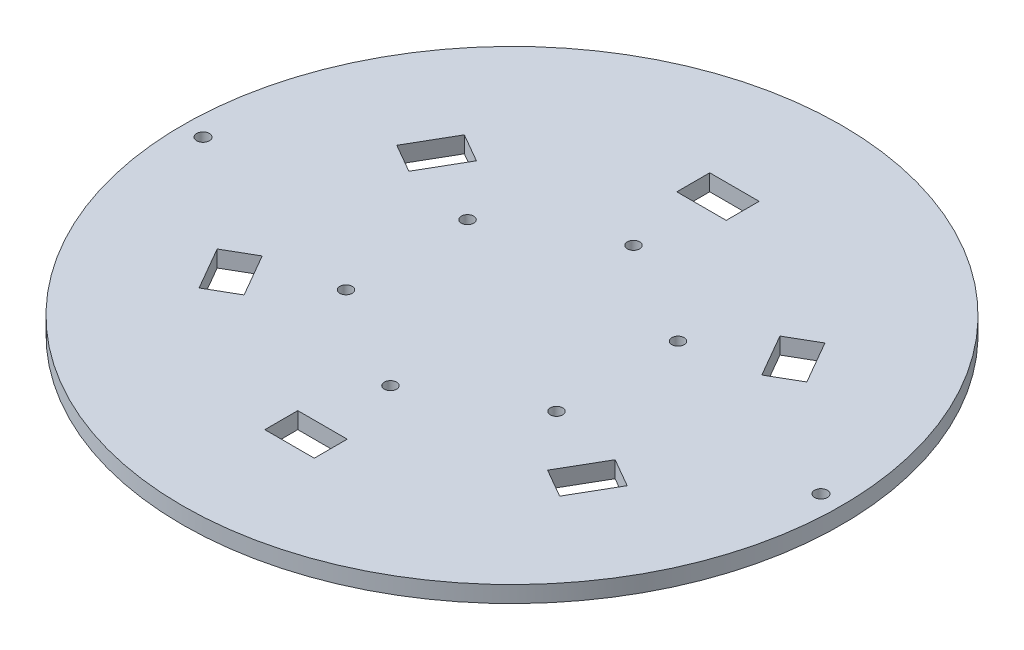
ISO-10303-21;
HEADER;
FILE_DESCRIPTION(('STEP AP214'),'2;1');
FILE_NAME('part.step','',(''),(''),'','','');
FILE_SCHEMA(('AUTOMOTIVE_DESIGN { 1 0 10303 214 1 1 1 1 }'));
ENDSEC;
DATA;
#1=APPLICATION_CONTEXT('core data for automotive mechanical design processes');
#2=APPLICATION_PROTOCOL_DEFINITION('international standard','automotive_design',2000,#1);
#3=PRODUCT_CONTEXT('',#1,'mechanical');
#4=PRODUCT('Part','Part','',(#3));
#5=PRODUCT_RELATED_PRODUCT_CATEGORY('part','',(#4));
#6=PRODUCT_DEFINITION_FORMATION('','',#4);
#7=PRODUCT_DEFINITION_CONTEXT('part definition',#1,'design');
#8=PRODUCT_DEFINITION('design','',#6,#7);
#9=PRODUCT_DEFINITION_SHAPE('','',#8);
#10=(LENGTH_UNIT() NAMED_UNIT(*) SI_UNIT(.MILLI.,.METRE.));
#11=(NAMED_UNIT(*) PLANE_ANGLE_UNIT() SI_UNIT($,.RADIAN.));
#12=(NAMED_UNIT(*) SI_UNIT($,.STERADIAN.) SOLID_ANGLE_UNIT());
#13=UNCERTAINTY_MEASURE_WITH_UNIT(LENGTH_MEASURE(1.E-05),#10,'distance_accuracy_value','');
#14=(GEOMETRIC_REPRESENTATION_CONTEXT(3) GLOBAL_UNCERTAINTY_ASSIGNED_CONTEXT((#13)) GLOBAL_UNIT_ASSIGNED_CONTEXT((#10,
#11,#12)) REPRESENTATION_CONTEXT('',''));
#15=CARTESIAN_POINT('',(0.,0.,0.));
#16=DIRECTION('',(0.,0.,1.));
#17=DIRECTION('',(1.,0.,0.));
#18=AXIS2_PLACEMENT_3D('',#15,#16,#17);
#19=CARTESIAN_POINT('',(0.,2.,0.));
#20=DIRECTION('',(0.,-1.,0.));
#21=DIRECTION('',(0.,0.,-1.));
#22=AXIS2_PLACEMENT_3D('',#19,#20,#21);
#23=CYLINDRICAL_SURFACE('',#22,80.);
#24=CARTESIAN_POINT('',(0.,-2.,0.));
#25=DIRECTION('',(0.,1.,0.));
#26=DIRECTION('',(0.,0.,1.));
#27=AXIS2_PLACEMENT_3D('',#24,#25,#26);
#28=CIRCLE('',#27,80.);
#29=CARTESIAN_POINT('',(0.,-2.,80.));
#30=VERTEX_POINT('',#29);
#31=EDGE_CURVE('E46',#30,#30,#28,.T.);
#32=ORIENTED_EDGE('',*,*,#31,.T.);
#33=EDGE_LOOP('',(#32));
#34=FACE_BOUND('',#33,.T.);
#35=CARTESIAN_POINT('',(0.,2.,0.));
#36=DIRECTION('',(0.,1.,0.));
#37=DIRECTION('',(0.,0.,-1.));
#38=AXIS2_PLACEMENT_3D('',#35,#36,#37);
#39=CIRCLE('',#38,80.);
#40=CARTESIAN_POINT('',(0.,2.,-80.));
#41=VERTEX_POINT('',#40);
#42=EDGE_CURVE('E11',#41,#41,#39,.T.);
#43=ORIENTED_EDGE('',*,*,#42,.F.);
#44=EDGE_LOOP('',(#43));
#45=FACE_BOUND('',#44,.T.);
#46=ADVANCED_FACE('F38',(#34,#45),#23,.T.);
#47=CARTESIAN_POINT('',(0.,2.,0.));
#48=DIRECTION('',(0.,-1.,0.));
#49=DIRECTION('',(0.,0.,-1.));
#50=AXIS2_PLACEMENT_3D('',#47,#48,#49);
#51=PLANE('',#50);
#52=CARTESIAN_POINT('',(4.39839137333919E-12,2.,29.4999999999997));
#53=DIRECTION('',(0.,1.,0.));
#54=DIRECTION('',(0.,0.,1.));
#55=AXIS2_PLACEMENT_3D('',#52,#53,#54);
#56=CIRCLE('',#55,1.5);
#57=CARTESIAN_POINT('',(4.39839137333919E-12,2.,30.9999999999997));
#58=VERTEX_POINT('',#57);
#59=EDGE_CURVE('E418',#58,#58,#56,.T.);
#60=ORIENTED_EDGE('',*,*,#59,.F.);
#61=EDGE_LOOP('',(#60));
#62=FACE_BOUND('',#61,.T.);
#63=CARTESIAN_POINT('',(-25.5477494116402,2.,-14.749999999998));
#64=DIRECTION('',(0.,1.,0.));
#65=DIRECTION('',(0.,0.,1.));
#66=AXIS2_PLACEMENT_3D('',#63,#64,#65);
#67=CIRCLE('',#66,1.5);
#68=CARTESIAN_POINT('',(-25.5477494116402,2.,-13.249999999998));
#69=VERTEX_POINT('',#68);
#70=EDGE_CURVE('E468',#69,#69,#67,.T.);
#71=ORIENTED_EDGE('',*,*,#70,.F.);
#72=EDGE_LOOP('',(#71));
#73=FACE_BOUND('',#72,.T.);
#74=CARTESIAN_POINT('',(-25.5477494116377,2.,14.7500000000019));
#75=DIRECTION('',(0.,1.,0.));
#76=DIRECTION('',(0.,0.,1.));
#77=AXIS2_PLACEMENT_3D('',#74,#75,#76);
#78=CIRCLE('',#77,1.5);
#79=CARTESIAN_POINT('',(-25.5477494116377,2.,16.2500000000019));
#80=VERTEX_POINT('',#79);
#81=EDGE_CURVE('E463',#80,#80,#78,.T.);
#82=ORIENTED_EDGE('',*,*,#81,.F.);
#83=EDGE_LOOP('',(#82));
#84=FACE_BOUND('',#83,.T.);
#85=CARTESIAN_POINT('',(25.547749411644,2.,14.7499999999976));
#86=DIRECTION('',(0.,1.,0.));
#87=DIRECTION('',(0.,0.,1.));
#88=AXIS2_PLACEMENT_3D('',#85,#86,#87);
#89=CIRCLE('',#88,1.5);
#90=CARTESIAN_POINT('',(25.547749411644,2.,16.2499999999976));
#91=VERTEX_POINT('',#90);
#92=EDGE_CURVE('E459',#91,#91,#89,.T.);
#93=ORIENTED_EDGE('',*,*,#92,.F.);
#94=EDGE_LOOP('',(#93));
#95=FACE_BOUND('',#94,.T.);
#96=CARTESIAN_POINT('',(25.5477494116415,2.,-14.7500000000023));
#97=DIRECTION('',(0.,1.,0.));
#98=DIRECTION('',(0.,0.,1.));
#99=AXIS2_PLACEMENT_3D('',#96,#97,#98);
#100=CIRCLE('',#99,1.5);
#101=CARTESIAN_POINT('',(25.5477494116415,2.,-13.2500000000023));
#102=VERTEX_POINT('',#101);
#103=EDGE_CURVE('E457',#102,#102,#100,.T.);
#104=ORIENTED_EDGE('',*,*,#103,.F.);
#105=EDGE_LOOP('',(#104));
#106=FACE_BOUND('',#105,.T.);
#107=CARTESIAN_POINT('',(-5.01335084557297E-13,2.,-29.5000000000001));
#108=DIRECTION('',(0.,1.,0.));
#109=DIRECTION('',(0.,0.,1.));
#110=AXIS2_PLACEMENT_3D('',#107,#108,#109);
#111=CIRCLE('',#110,1.5);
#112=CARTESIAN_POINT('',(-5.01335084557297E-13,2.,-28.0000000000001));
#113=VERTEX_POINT('',#112);
#114=EDGE_CURVE('E227',#113,#113,#111,.T.);
#115=ORIENTED_EDGE('',*,*,#114,.F.);
#116=EDGE_LOOP('',(#115));
#117=FACE_BOUND('',#116,.T.);
#118=DIRECTION('',(-1.,0.,0.));
#119=VECTOR('',#118,1.);
#120=CARTESIAN_POINT('',(-6.,2.,-54.));
#121=LINE('',#120,#119);
#122=CARTESIAN_POINT('',(6.,2.,-54.));
#123=VERTEX_POINT('',#122);
#124=CARTESIAN_POINT('',(-6.,2.,-54.));
#125=VERTEX_POINT('',#124);
#126=EDGE_CURVE('E233',#123,#125,#121,.T.);
#127=ORIENTED_EDGE('',*,*,#126,.F.);
#128=DIRECTION('',(0.,0.,-1.));
#129=VECTOR('',#128,1.);
#130=CARTESIAN_POINT('',(6.,2.,-54.));
#131=LINE('',#130,#129);
#132=CARTESIAN_POINT('',(6.,2.,-46.));
#133=VERTEX_POINT('',#132);
#134=EDGE_CURVE('E54',#133,#123,#131,.T.);
#135=ORIENTED_EDGE('',*,*,#134,.F.);
#136=DIRECTION('',(1.,0.,0.));
#137=VECTOR('',#136,1.);
#138=CARTESIAN_POINT('',(-6.,2.,-46.));
#139=LINE('',#138,#137);
#140=CARTESIAN_POINT('',(-6.,2.,-46.));
#141=VERTEX_POINT('',#140);
#142=EDGE_CURVE('E221',#141,#133,#139,.T.);
#143=ORIENTED_EDGE('',*,*,#142,.F.);
#144=DIRECTION('',(0.,0.,1.));
#145=VECTOR('',#144,1.);
#146=CARTESIAN_POINT('',(-6.,2.,-54.));
#147=LINE('',#146,#145);
#148=EDGE_CURVE('E224',#125,#141,#147,.T.);
#149=ORIENTED_EDGE('',*,*,#148,.F.);
#150=EDGE_LOOP('',(#127,#135,#143,#149));
#151=FACE_BOUND('',#150,.T.);
#152=DIRECTION('',(-0.499999999999999,0.,0.866025403784439));
#153=VECTOR('',#152,1.);
#154=CARTESIAN_POINT('',(-49.7653718043585,2.,-21.8038475772918));
#155=LINE('',#154,#153);
#156=CARTESIAN_POINT('',(-43.7653718043585,2.,-32.196152422705));
#157=VERTEX_POINT('',#156);
#158=CARTESIAN_POINT('',(-49.7653718043585,2.,-21.8038475772918));
#159=VERTEX_POINT('',#158);
#160=EDGE_CURVE('E259',#157,#159,#155,.T.);
#161=ORIENTED_EDGE('',*,*,#160,.F.);
#162=DIRECTION('',(-0.866025403784439,0.,-0.5));
#163=VECTOR('',#162,1.);
#164=CARTESIAN_POINT('',(-43.7653718043585,2.,-32.196152422705));
#165=LINE('',#164,#163);
#166=CARTESIAN_POINT('',(-36.837168574083,2.,-28.1961524227051));
#167=VERTEX_POINT('',#166);
#168=EDGE_CURVE('E62',#167,#157,#165,.T.);
#169=ORIENTED_EDGE('',*,*,#168,.F.);
#170=DIRECTION('',(0.499999999999999,0.,-0.866025403784439));
#171=VECTOR('',#170,1.);
#172=CARTESIAN_POINT('',(-42.837168574083,2.,-17.8038475772918));
#173=LINE('',#172,#171);
#174=CARTESIAN_POINT('',(-42.837168574083,2.,-17.8038475772918));
#175=VERTEX_POINT('',#174);
#176=EDGE_CURVE('E248',#175,#167,#173,.T.);
#177=ORIENTED_EDGE('',*,*,#176,.F.);
#178=DIRECTION('',(0.866025403784439,0.,0.5));
#179=VECTOR('',#178,1.);
#180=CARTESIAN_POINT('',(-49.7653718043585,2.,-21.8038475772918));
#181=LINE('',#180,#179);
#182=EDGE_CURVE('E262',#159,#175,#181,.T.);
#183=ORIENTED_EDGE('',*,*,#182,.F.);
#184=EDGE_LOOP('',(#161,#169,#177,#183));
#185=FACE_BOUND('',#184,.T.);
#186=DIRECTION('',(0.5,0.,0.866025403784439));
#187=VECTOR('',#186,1.);
#188=CARTESIAN_POINT('',(-43.7653718043566,2.,32.196152422708));
#189=LINE('',#188,#187);
#190=CARTESIAN_POINT('',(-49.7653718043566,2.,21.8038475772947));
#191=VERTEX_POINT('',#190);
#192=CARTESIAN_POINT('',(-43.7653718043566,2.,32.196152422708));
#193=VERTEX_POINT('',#192);
#194=EDGE_CURVE('E386',#191,#193,#189,.T.);
#195=ORIENTED_EDGE('',*,*,#194,.F.);
#196=DIRECTION('',(-0.866025403784438,0.,0.500000000000001));
#197=VECTOR('',#196,1.);
#198=CARTESIAN_POINT('',(-49.7653718043566,2.,21.8038475772947));
#199=LINE('',#198,#197);
#200=CARTESIAN_POINT('',(-42.8371685740811,2.,17.8038475772947));
#201=VERTEX_POINT('',#200);
#202=EDGE_CURVE('E269',#201,#191,#199,.T.);
#203=ORIENTED_EDGE('',*,*,#202,.F.);
#204=DIRECTION('',(-0.5,0.,-0.866025403784438));
#205=VECTOR('',#204,1.);
#206=CARTESIAN_POINT('',(-36.8371685740811,2.,28.196152422708));
#207=LINE('',#206,#205);
#208=CARTESIAN_POINT('',(-36.8371685740811,2.,28.196152422708));
#209=VERTEX_POINT('',#208);
#210=EDGE_CURVE('E375',#209,#201,#207,.T.);
#211=ORIENTED_EDGE('',*,*,#210,.F.);
#212=DIRECTION('',(0.866025403784438,0.,-0.500000000000001));
#213=VECTOR('',#212,1.);
#214=CARTESIAN_POINT('',(-43.7653718043566,2.,32.196152422708));
#215=LINE('',#214,#213);
#216=EDGE_CURVE('E389',#193,#209,#215,.T.);
#217=ORIENTED_EDGE('',*,*,#216,.F.);
#218=EDGE_LOOP('',(#195,#203,#211,#217));
#219=FACE_BOUND('',#218,.T.);
#220=DIRECTION('',(1.,0.,0.));
#221=VECTOR('',#220,1.);
#222=CARTESIAN_POINT('',(6.00000000000388,2.,53.9999999999995));
#223=LINE('',#222,#221);
#224=CARTESIAN_POINT('',(-5.99999999999612,2.,53.9999999999995));
#225=VERTEX_POINT('',#224);
#226=CARTESIAN_POINT('',(6.00000000000388,2.,53.9999999999995));
#227=VERTEX_POINT('',#226);
#228=EDGE_CURVE('E355',#225,#227,#223,.T.);
#229=ORIENTED_EDGE('',*,*,#228,.F.);
#230=DIRECTION('',(0.,0.,1.));
#231=VECTOR('',#230,1.);
#232=CARTESIAN_POINT('',(-5.99999999999612,2.,53.9999999999995));
#233=LINE('',#232,#231);
#234=CARTESIAN_POINT('',(-5.99999999999612,2.,45.9999999999995));
#235=VERTEX_POINT('',#234);
#236=EDGE_CURVE('E353',#235,#225,#233,.T.);
#237=ORIENTED_EDGE('',*,*,#236,.F.);
#238=DIRECTION('',(-1.,0.,0.));
#239=VECTOR('',#238,1.);
#240=CARTESIAN_POINT('',(6.00000000000388,2.,45.9999999999995));
#241=LINE('',#240,#239);
#242=CARTESIAN_POINT('',(6.00000000000388,2.,45.9999999999995));
#243=VERTEX_POINT('',#242);
#244=EDGE_CURVE('E343',#243,#235,#241,.T.);
#245=ORIENTED_EDGE('',*,*,#244,.F.);
#246=DIRECTION('',(0.,0.,-1.));
#247=VECTOR('',#246,1.);
#248=CARTESIAN_POINT('',(6.00000000000388,2.,53.9999999999995));
#249=LINE('',#248,#247);
#250=EDGE_CURVE('E359',#227,#243,#249,.T.);
#251=ORIENTED_EDGE('',*,*,#250,.F.);
#252=EDGE_LOOP('',(#229,#237,#245,#251));
#253=FACE_BOUND('',#252,.T.);
#254=DIRECTION('',(0.5,0.,-0.866025403784438));
#255=VECTOR('',#254,1.);
#256=CARTESIAN_POINT('',(49.7653718043624,2.,21.8038475772913));
#257=LINE('',#256,#255);
#258=CARTESIAN_POINT('',(43.7653718043624,2.,32.1961524227046));
#259=VERTEX_POINT('',#258);
#260=CARTESIAN_POINT('',(49.7653718043624,2.,21.8038475772913));
#261=VERTEX_POINT('',#260);
#262=EDGE_CURVE('E323',#259,#261,#257,.T.);
#263=ORIENTED_EDGE('',*,*,#262,.F.);
#264=DIRECTION('',(0.866025403784439,0.,0.499999999999999));
#265=VECTOR('',#264,1.);
#266=CARTESIAN_POINT('',(43.7653718043624,2.,32.1961524227046));
#267=LINE('',#266,#265);
#268=CARTESIAN_POINT('',(36.8371685740869,2.,28.1961524227046));
#269=VERTEX_POINT('',#268);
#270=EDGE_CURVE('E321',#269,#259,#267,.T.);
#271=ORIENTED_EDGE('',*,*,#270,.F.);
#272=DIRECTION('',(-0.5,0.,0.866025403784439));
#273=VECTOR('',#272,1.);
#274=CARTESIAN_POINT('',(42.8371685740869,2.,17.8038475772913));
#275=LINE('',#274,#273);
#276=CARTESIAN_POINT('',(42.8371685740869,2.,17.8038475772913));
#277=VERTEX_POINT('',#276);
#278=EDGE_CURVE('E311',#277,#269,#275,.T.);
#279=ORIENTED_EDGE('',*,*,#278,.F.);
#280=DIRECTION('',(-0.866025403784439,0.,-0.499999999999999));
#281=VECTOR('',#280,1.);
#282=CARTESIAN_POINT('',(49.7653718043624,2.,21.8038475772913));
#283=LINE('',#282,#281);
#284=EDGE_CURVE('E327',#261,#277,#283,.T.);
#285=ORIENTED_EDGE('',*,*,#284,.F.);
#286=EDGE_LOOP('',(#263,#271,#279,#285));
#287=FACE_BOUND('',#286,.T.);
#288=DIRECTION('',(-0.5,0.,-0.866025403784438));
#289=VECTOR('',#288,1.);
#290=CARTESIAN_POINT('',(43.7653718043604,2.,-32.1961524227084));
#291=LINE('',#290,#289);
#292=CARTESIAN_POINT('',(49.7653718043605,2.,-21.8038475772952));
#293=VERTEX_POINT('',#292);
#294=CARTESIAN_POINT('',(43.7653718043604,2.,-32.1961524227084));
#295=VERTEX_POINT('',#294);
#296=EDGE_CURVE('E291',#293,#295,#291,.T.);
#297=ORIENTED_EDGE('',*,*,#296,.F.);
#298=DIRECTION('',(0.866025403784438,0.,-0.500000000000001));
#299=VECTOR('',#298,1.);
#300=CARTESIAN_POINT('',(49.7653718043605,2.,-21.8038475772952));
#301=LINE('',#300,#299);
#302=CARTESIAN_POINT('',(42.8371685740849,2.,-17.8038475772952));
#303=VERTEX_POINT('',#302);
#304=EDGE_CURVE('E289',#303,#293,#301,.T.);
#305=ORIENTED_EDGE('',*,*,#304,.F.);
#306=DIRECTION('',(0.5,0.,0.866025403784438));
#307=VECTOR('',#306,1.);
#308=CARTESIAN_POINT('',(36.8371685740849,2.,-28.1961524227084));
#309=LINE('',#308,#307);
#310=CARTESIAN_POINT('',(36.8371685740849,2.,-28.1961524227084));
#311=VERTEX_POINT('',#310);
#312=EDGE_CURVE('E279',#311,#303,#309,.T.);
#313=ORIENTED_EDGE('',*,*,#312,.F.);
#314=DIRECTION('',(-0.866025403784438,0.,0.500000000000001));
#315=VECTOR('',#314,1.);
#316=CARTESIAN_POINT('',(43.7653718043604,2.,-32.1961524227084));
#317=LINE('',#316,#315);
#318=EDGE_CURVE('E295',#295,#311,#317,.T.);
#319=ORIENTED_EDGE('',*,*,#318,.F.);
#320=EDGE_LOOP('',(#297,#305,#313,#319));
#321=FACE_BOUND('',#320,.T.);
#322=CARTESIAN_POINT('',(75.,2.,0.));
#323=DIRECTION('',(0.,-1.,0.));
#324=DIRECTION('',(0.,0.,-1.));
#325=AXIS2_PLACEMENT_3D('',#322,#323,#324);
#326=CIRCLE('',#325,1.54999999999999);
#327=CARTESIAN_POINT('',(75.,2.,-1.55000000000001));
#328=VERTEX_POINT('',#327);
#329=EDGE_CURVE('E401',#328,#328,#326,.T.);
#330=ORIENTED_EDGE('',*,*,#329,.T.);
#331=EDGE_LOOP('',(#330));
#332=FACE_BOUND('',#331,.T.);
#333=CARTESIAN_POINT('',(-75.,2.,0.));
#334=DIRECTION('',(0.,-1.,0.));
#335=DIRECTION('',(0.,0.,-1.));
#336=AXIS2_PLACEMENT_3D('',#333,#334,#335);
#337=CIRCLE('',#336,1.54999999999999);
#338=CARTESIAN_POINT('',(-75.,2.,-1.54999999999999));
#339=VERTEX_POINT('',#338);
#340=EDGE_CURVE('E407',#339,#339,#337,.T.);
#341=ORIENTED_EDGE('',*,*,#340,.T.);
#342=EDGE_LOOP('',(#341));
#343=FACE_BOUND('',#342,.T.);
#344=ORIENTED_EDGE('',*,*,#42,.T.);
#345=EDGE_LOOP('',(#344));
#346=FACE_BOUND('',#345,.T.);
#347=ADVANCED_FACE('F439',(#62,#73,#84,#95,#106,#117,#151,#185,#219,#253,#287,#321,#332,#343,
#346),#51,.F.);
#348=CARTESIAN_POINT('',(0.,-2.,0.));
#349=DIRECTION('',(0.,-1.,0.));
#350=DIRECTION('',(0.,0.,-1.));
#351=AXIS2_PLACEMENT_3D('',#348,#349,#350);
#352=PLANE('',#351);
#353=CARTESIAN_POINT('',(4.39839137333919E-12,-2.,29.4999999999997));
#354=DIRECTION('',(0.,-1.,0.));
#355=DIRECTION('',(0.,0.,-1.));
#356=AXIS2_PLACEMENT_3D('',#353,#354,#355);
#357=CIRCLE('',#356,1.5);
#358=CARTESIAN_POINT('',(4.39839137333919E-12,-2.,27.9999999999997));
#359=VERTEX_POINT('',#358);
#360=EDGE_CURVE('E41',#359,#359,#357,.T.);
#361=ORIENTED_EDGE('',*,*,#360,.F.);
#362=EDGE_LOOP('',(#361));
#363=FACE_BOUND('',#362,.T.);
#364=CARTESIAN_POINT('',(-25.5477494116402,-2.,-14.749999999998));
#365=DIRECTION('',(0.,-1.,0.));
#366=DIRECTION('',(0.,0.,-1.));
#367=AXIS2_PLACEMENT_3D('',#364,#365,#366);
#368=CIRCLE('',#367,1.5);
#369=CARTESIAN_POINT('',(-25.5477494116402,-2.,-16.249999999998));
#370=VERTEX_POINT('',#369);
#371=EDGE_CURVE('E426',#370,#370,#368,.T.);
#372=ORIENTED_EDGE('',*,*,#371,.F.);
#373=EDGE_LOOP('',(#372));
#374=FACE_BOUND('',#373,.T.);
#375=CARTESIAN_POINT('',(-25.5477494116377,-2.,14.7500000000019));
#376=DIRECTION('',(0.,-1.,0.));
#377=DIRECTION('',(0.,0.,-1.));
#378=AXIS2_PLACEMENT_3D('',#375,#376,#377);
#379=CIRCLE('',#378,1.5);
#380=CARTESIAN_POINT('',(-25.5477494116377,-2.,13.2500000000019));
#381=VERTEX_POINT('',#380);
#382=EDGE_CURVE('E424',#381,#381,#379,.T.);
#383=ORIENTED_EDGE('',*,*,#382,.F.);
#384=EDGE_LOOP('',(#383));
#385=FACE_BOUND('',#384,.T.);
#386=CARTESIAN_POINT('',(25.547749411644,-2.,14.7499999999976));
#387=DIRECTION('',(0.,-1.,0.));
#388=DIRECTION('',(0.,0.,-1.));
#389=AXIS2_PLACEMENT_3D('',#386,#387,#388);
#390=CIRCLE('',#389,1.5);
#391=CARTESIAN_POINT('',(25.547749411644,-2.,13.2499999999976));
#392=VERTEX_POINT('',#391);
#393=EDGE_CURVE('E421',#392,#392,#390,.T.);
#394=ORIENTED_EDGE('',*,*,#393,.F.);
#395=EDGE_LOOP('',(#394));
#396=FACE_BOUND('',#395,.T.);
#397=CARTESIAN_POINT('',(25.5477494116415,-2.,-14.7500000000023));
#398=DIRECTION('',(0.,-1.,0.));
#399=DIRECTION('',(0.,0.,-1.));
#400=AXIS2_PLACEMENT_3D('',#397,#398,#399);
#401=CIRCLE('',#400,1.5);
#402=CARTESIAN_POINT('',(25.5477494116415,-2.,-16.2500000000023));
#403=VERTEX_POINT('',#402);
#404=EDGE_CURVE('E417',#403,#403,#401,.T.);
#405=ORIENTED_EDGE('',*,*,#404,.F.);
#406=EDGE_LOOP('',(#405));
#407=FACE_BOUND('',#406,.T.);
#408=CARTESIAN_POINT('',(-5.01335084557297E-13,-2.,-29.5000000000001));
#409=DIRECTION('',(0.,-1.,0.));
#410=DIRECTION('',(0.,0.,-1.));
#411=AXIS2_PLACEMENT_3D('',#408,#409,#410);
#412=CIRCLE('',#411,1.5);
#413=CARTESIAN_POINT('',(-5.01335084557297E-13,-2.,-31.0000000000001));
#414=VERTEX_POINT('',#413);
#415=EDGE_CURVE('E414',#414,#414,#412,.T.);
#416=ORIENTED_EDGE('',*,*,#415,.F.);
#417=EDGE_LOOP('',(#416));
#418=FACE_BOUND('',#417,.T.);
#419=DIRECTION('',(0.,0.,-1.));
#420=VECTOR('',#419,1.);
#421=CARTESIAN_POINT('',(6.,-2.,-54.));
#422=LINE('',#421,#420);
#423=CARTESIAN_POINT('',(6.,-2.,-46.));
#424=VERTEX_POINT('',#423);
#425=CARTESIAN_POINT('',(6.,-2.,-54.));
#426=VERTEX_POINT('',#425);
#427=EDGE_CURVE('E202',#424,#426,#422,.T.);
#428=ORIENTED_EDGE('',*,*,#427,.T.);
#429=DIRECTION('',(-1.,0.,0.));
#430=VECTOR('',#429,1.);
#431=CARTESIAN_POINT('',(-6.,-2.,-54.));
#432=LINE('',#431,#430);
#433=CARTESIAN_POINT('',(-6.,-2.,-54.));
#434=VERTEX_POINT('',#433);
#435=EDGE_CURVE('E212',#426,#434,#432,.T.);
#436=ORIENTED_EDGE('',*,*,#435,.T.);
#437=DIRECTION('',(0.,0.,1.));
#438=VECTOR('',#437,1.);
#439=CARTESIAN_POINT('',(-6.,-2.,-54.));
#440=LINE('',#439,#438);
#441=CARTESIAN_POINT('',(-6.,-2.,-46.));
#442=VERTEX_POINT('',#441);
#443=EDGE_CURVE('E216',#434,#442,#440,.T.);
#444=ORIENTED_EDGE('',*,*,#443,.T.);
#445=DIRECTION('',(1.,0.,0.));
#446=VECTOR('',#445,1.);
#447=CARTESIAN_POINT('',(-6.,-2.,-46.));
#448=LINE('',#447,#446);
#449=EDGE_CURVE('E208',#442,#424,#448,.T.);
#450=ORIENTED_EDGE('',*,*,#449,.T.);
#451=EDGE_LOOP('',(#428,#436,#444,#450));
#452=FACE_BOUND('',#451,.T.);
#453=DIRECTION('',(-0.866025403784439,0.,-0.5));
#454=VECTOR('',#453,1.);
#455=CARTESIAN_POINT('',(-43.7653718043585,-2.,-32.196152422705));
#456=LINE('',#455,#454);
#457=CARTESIAN_POINT('',(-36.837168574083,-2.,-28.1961524227051));
#458=VERTEX_POINT('',#457);
#459=CARTESIAN_POINT('',(-43.7653718043585,-2.,-32.196152422705));
#460=VERTEX_POINT('',#459);
#461=EDGE_CURVE('E244',#458,#460,#456,.T.);
#462=ORIENTED_EDGE('',*,*,#461,.T.);
#463=DIRECTION('',(-0.499999999999999,0.,0.866025403784439));
#464=VECTOR('',#463,1.);
#465=CARTESIAN_POINT('',(-49.7653718043585,-2.,-21.8038475772918));
#466=LINE('',#465,#464);
#467=CARTESIAN_POINT('',(-49.7653718043585,-2.,-21.8038475772918));
#468=VERTEX_POINT('',#467);
#469=EDGE_CURVE('E247',#460,#468,#466,.T.);
#470=ORIENTED_EDGE('',*,*,#469,.T.);
#471=DIRECTION('',(0.866025403784439,0.,0.5));
#472=VECTOR('',#471,1.);
#473=CARTESIAN_POINT('',(-49.7653718043585,-2.,-21.8038475772918));
#474=LINE('',#473,#472);
#475=CARTESIAN_POINT('',(-42.837168574083,-2.,-17.8038475772918));
#476=VERTEX_POINT('',#475);
#477=EDGE_CURVE('E251',#468,#476,#474,.T.);
#478=ORIENTED_EDGE('',*,*,#477,.T.);
#479=DIRECTION('',(0.499999999999999,0.,-0.866025403784439));
#480=VECTOR('',#479,1.);
#481=CARTESIAN_POINT('',(-42.837168574083,-2.,-17.8038475772918));
#482=LINE('',#481,#480);
#483=EDGE_CURVE('E254',#476,#458,#482,.T.);
#484=ORIENTED_EDGE('',*,*,#483,.T.);
#485=EDGE_LOOP('',(#462,#470,#478,#484));
#486=FACE_BOUND('',#485,.T.);
#487=DIRECTION('',(-0.866025403784438,0.,0.500000000000001));
#488=VECTOR('',#487,1.);
#489=CARTESIAN_POINT('',(-49.7653718043566,-2.,21.8038475772947));
#490=LINE('',#489,#488);
#491=CARTESIAN_POINT('',(-42.8371685740811,-2.,17.8038475772947));
#492=VERTEX_POINT('',#491);
#493=CARTESIAN_POINT('',(-49.7653718043566,-2.,21.8038475772947));
#494=VERTEX_POINT('',#493);
#495=EDGE_CURVE('E371',#492,#494,#490,.T.);
#496=ORIENTED_EDGE('',*,*,#495,.T.);
#497=DIRECTION('',(0.5,0.,0.866025403784439));
#498=VECTOR('',#497,1.);
#499=CARTESIAN_POINT('',(-43.7653718043566,-2.,32.196152422708));
#500=LINE('',#499,#498);
#501=CARTESIAN_POINT('',(-43.7653718043566,-2.,32.196152422708));
#502=VERTEX_POINT('',#501);
#503=EDGE_CURVE('E374',#494,#502,#500,.T.);
#504=ORIENTED_EDGE('',*,*,#503,.T.);
#505=DIRECTION('',(0.866025403784438,0.,-0.500000000000001));
#506=VECTOR('',#505,1.);
#507=CARTESIAN_POINT('',(-43.7653718043566,-2.,32.196152422708));
#508=LINE('',#507,#506);
#509=CARTESIAN_POINT('',(-36.8371685740811,-2.,28.196152422708));
#510=VERTEX_POINT('',#509);
#511=EDGE_CURVE('E378',#502,#510,#508,.T.);
#512=ORIENTED_EDGE('',*,*,#511,.T.);
#513=DIRECTION('',(-0.5,0.,-0.866025403784438));
#514=VECTOR('',#513,1.);
#515=CARTESIAN_POINT('',(-36.8371685740811,-2.,28.196152422708));
#516=LINE('',#515,#514);
#517=EDGE_CURVE('E381',#510,#492,#516,.T.);
#518=ORIENTED_EDGE('',*,*,#517,.T.);
#519=EDGE_LOOP('',(#496,#504,#512,#518));
#520=FACE_BOUND('',#519,.T.);
#521=DIRECTION('',(0.,0.,1.));
#522=VECTOR('',#521,1.);
#523=CARTESIAN_POINT('',(-5.99999999999612,-2.,53.9999999999995));
#524=LINE('',#523,#522);
#525=CARTESIAN_POINT('',(-5.99999999999612,-2.,45.9999999999995));
#526=VERTEX_POINT('',#525);
#527=CARTESIAN_POINT('',(-5.99999999999612,-2.,53.9999999999995));
#528=VERTEX_POINT('',#527);
#529=EDGE_CURVE('E339',#526,#528,#524,.T.);
#530=ORIENTED_EDGE('',*,*,#529,.T.);
#531=DIRECTION('',(1.,0.,0.));
#532=VECTOR('',#531,1.);
#533=CARTESIAN_POINT('',(6.00000000000388,-2.,53.9999999999995));
#534=LINE('',#533,#532);
#535=CARTESIAN_POINT('',(6.00000000000388,-2.,53.9999999999995));
#536=VERTEX_POINT('',#535);
#537=EDGE_CURVE('E342',#528,#536,#534,.T.);
#538=ORIENTED_EDGE('',*,*,#537,.T.);
#539=DIRECTION('',(0.,0.,-1.));
#540=VECTOR('',#539,1.);
#541=CARTESIAN_POINT('',(6.00000000000388,-2.,53.9999999999995));
#542=LINE('',#541,#540);
#543=CARTESIAN_POINT('',(6.00000000000388,-2.,45.9999999999995));
#544=VERTEX_POINT('',#543);
#545=EDGE_CURVE('E346',#536,#544,#542,.T.);
#546=ORIENTED_EDGE('',*,*,#545,.T.);
#547=DIRECTION('',(-1.,0.,0.));
#548=VECTOR('',#547,1.);
#549=CARTESIAN_POINT('',(6.00000000000388,-2.,45.9999999999995));
#550=LINE('',#549,#548);
#551=EDGE_CURVE('E349',#544,#526,#550,.T.);
#552=ORIENTED_EDGE('',*,*,#551,.T.);
#553=EDGE_LOOP('',(#530,#538,#546,#552));
#554=FACE_BOUND('',#553,.T.);
#555=DIRECTION('',(0.866025403784439,0.,0.499999999999999));
#556=VECTOR('',#555,1.);
#557=CARTESIAN_POINT('',(43.7653718043624,-2.,32.1961524227046));
#558=LINE('',#557,#556);
#559=CARTESIAN_POINT('',(36.8371685740869,-2.,28.1961524227046));
#560=VERTEX_POINT('',#559);
#561=CARTESIAN_POINT('',(43.7653718043624,-2.,32.1961524227046));
#562=VERTEX_POINT('',#561);
#563=EDGE_CURVE('E307',#560,#562,#558,.T.);
#564=ORIENTED_EDGE('',*,*,#563,.T.);
#565=DIRECTION('',(0.5,0.,-0.866025403784438));
#566=VECTOR('',#565,1.);
#567=CARTESIAN_POINT('',(49.7653718043624,-2.,21.8038475772913));
#568=LINE('',#567,#566);
#569=CARTESIAN_POINT('',(49.7653718043624,-2.,21.8038475772913));
#570=VERTEX_POINT('',#569);
#571=EDGE_CURVE('E310',#562,#570,#568,.T.);
#572=ORIENTED_EDGE('',*,*,#571,.T.);
#573=DIRECTION('',(-0.866025403784439,0.,-0.499999999999999));
#574=VECTOR('',#573,1.);
#575=CARTESIAN_POINT('',(49.7653718043624,-2.,21.8038475772913));
#576=LINE('',#575,#574);
#577=CARTESIAN_POINT('',(42.8371685740869,-2.,17.8038475772913));
#578=VERTEX_POINT('',#577);
#579=EDGE_CURVE('E314',#570,#578,#576,.T.);
#580=ORIENTED_EDGE('',*,*,#579,.T.);
#581=DIRECTION('',(-0.5,0.,0.866025403784439));
#582=VECTOR('',#581,1.);
#583=CARTESIAN_POINT('',(42.8371685740869,-2.,17.8038475772913));
#584=LINE('',#583,#582);
#585=EDGE_CURVE('E317',#578,#560,#584,.T.);
#586=ORIENTED_EDGE('',*,*,#585,.T.);
#587=EDGE_LOOP('',(#564,#572,#580,#586));
#588=FACE_BOUND('',#587,.T.);
#589=DIRECTION('',(0.866025403784438,0.,-0.500000000000001));
#590=VECTOR('',#589,1.);
#591=CARTESIAN_POINT('',(49.7653718043605,-2.,-21.8038475772952));
#592=LINE('',#591,#590);
#593=CARTESIAN_POINT('',(42.8371685740849,-2.,-17.8038475772952));
#594=VERTEX_POINT('',#593);
#595=CARTESIAN_POINT('',(49.7653718043605,-2.,-21.8038475772952));
#596=VERTEX_POINT('',#595);
#597=EDGE_CURVE('E275',#594,#596,#592,.T.);
#598=ORIENTED_EDGE('',*,*,#597,.T.);
#599=DIRECTION('',(-0.5,0.,-0.866025403784438));
#600=VECTOR('',#599,1.);
#601=CARTESIAN_POINT('',(43.7653718043604,-2.,-32.1961524227084));
#602=LINE('',#601,#600);
#603=CARTESIAN_POINT('',(43.7653718043605,-2.,-32.1961524227084));
#604=VERTEX_POINT('',#603);
#605=EDGE_CURVE('E278',#596,#604,#602,.T.);
#606=ORIENTED_EDGE('',*,*,#605,.T.);
#607=DIRECTION('',(-0.866025403784438,0.,0.500000000000001));
#608=VECTOR('',#607,1.);
#609=CARTESIAN_POINT('',(43.7653718043604,-2.,-32.1961524227084));
#610=LINE('',#609,#608);
#611=CARTESIAN_POINT('',(36.8371685740849,-2.,-28.1961524227084));
#612=VERTEX_POINT('',#611);
#613=EDGE_CURVE('E282',#604,#612,#610,.T.);
#614=ORIENTED_EDGE('',*,*,#613,.T.);
#615=DIRECTION('',(0.5,0.,0.866025403784438));
#616=VECTOR('',#615,1.);
#617=CARTESIAN_POINT('',(36.8371685740849,-2.,-28.1961524227084));
#618=LINE('',#617,#616);
#619=EDGE_CURVE('E285',#612,#594,#618,.T.);
#620=ORIENTED_EDGE('',*,*,#619,.T.);
#621=EDGE_LOOP('',(#598,#606,#614,#620));
#622=FACE_BOUND('',#621,.T.);
#623=CARTESIAN_POINT('',(75.,-2.,0.));
#624=DIRECTION('',(0.,-1.,0.));
#625=DIRECTION('',(0.,0.,-1.));
#626=AXIS2_PLACEMENT_3D('',#623,#624,#625);
#627=CIRCLE('',#626,1.54999999999999);
#628=CARTESIAN_POINT('',(75.,-2.,-1.55000000000001));
#629=VERTEX_POINT('',#628);
#630=EDGE_CURVE('E404',#629,#629,#627,.T.);
#631=ORIENTED_EDGE('',*,*,#630,.F.);
#632=EDGE_LOOP('',(#631));
#633=FACE_BOUND('',#632,.T.);
#634=CARTESIAN_POINT('',(-75.,-2.,0.));
#635=DIRECTION('',(0.,-1.,0.));
#636=DIRECTION('',(0.,0.,-1.));
#637=AXIS2_PLACEMENT_3D('',#634,#635,#636);
#638=CIRCLE('',#637,1.54999999999999);
#639=CARTESIAN_POINT('',(-75.,-2.,-1.54999999999999));
#640=VERTEX_POINT('',#639);
#641=EDGE_CURVE('E240',#640,#640,#638,.T.);
#642=ORIENTED_EDGE('',*,*,#641,.F.);
#643=EDGE_LOOP('',(#642));
#644=FACE_BOUND('',#643,.T.);
#645=ORIENTED_EDGE('',*,*,#31,.F.);
#646=EDGE_LOOP('',(#645));
#647=FACE_BOUND('',#646,.T.);
#648=ADVANCED_FACE('F218',(#363,#374,#385,#396,#407,#418,#452,#486,#520,#554,#588,#622,#633,
#644,#647),#352,.T.);
#649=CARTESIAN_POINT('',(-75.,2.,0.));
#650=DIRECTION('',(0.,-1.,0.));
#651=DIRECTION('',(0.,0.,-1.));
#652=AXIS2_PLACEMENT_3D('',#649,#650,#651);
#653=CYLINDRICAL_SURFACE('',#652,1.54999999999999);
#654=ORIENTED_EDGE('',*,*,#340,.F.);
#655=EDGE_LOOP('',(#654));
#656=FACE_BOUND('',#655,.T.);
#657=ORIENTED_EDGE('',*,*,#641,.T.);
#658=EDGE_LOOP('',(#657));
#659=FACE_BOUND('',#658,.T.);
#660=ADVANCED_FACE('F438',(#656,#659),#653,.F.);
#661=CARTESIAN_POINT('',(75.,2.,0.));
#662=DIRECTION('',(0.,-1.,0.));
#663=DIRECTION('',(0.,0.,-1.));
#664=AXIS2_PLACEMENT_3D('',#661,#662,#663);
#665=CYLINDRICAL_SURFACE('',#664,1.54999999999999);
#666=ORIENTED_EDGE('',*,*,#329,.F.);
#667=EDGE_LOOP('',(#666));
#668=FACE_BOUND('',#667,.T.);
#669=ORIENTED_EDGE('',*,*,#630,.T.);
#670=EDGE_LOOP('',(#669));
#671=FACE_BOUND('',#670,.T.);
#672=ADVANCED_FACE('F533',(#668,#671),#665,.F.);
#673=CARTESIAN_POINT('',(49.7653718043605,-2.,-21.8038475772952));
#674=DIRECTION('',(0.500000000000001,0.,0.866025403784438));
#675=DIRECTION('',(0.866025403784438,0.,-0.500000000000001));
#676=AXIS2_PLACEMENT_3D('',#673,#674,#675);
#677=PLANE('',#676);
#678=ORIENTED_EDGE('',*,*,#304,.T.);
#679=DIRECTION('',(0.,1.,0.));
#680=VECTOR('',#679,1.);
#681=CARTESIAN_POINT('',(49.7653718043605,-2.,-21.8038475772952));
#682=LINE('',#681,#680);
#683=EDGE_CURVE('E288',#596,#293,#682,.T.);
#684=ORIENTED_EDGE('',*,*,#683,.F.);
#685=ORIENTED_EDGE('',*,*,#597,.F.);
#686=DIRECTION('',(0.,1.,0.));
#687=VECTOR('',#686,1.);
#688=CARTESIAN_POINT('',(42.8371685740849,-2.,-17.8038475772952));
#689=LINE('',#688,#687);
#690=EDGE_CURVE('E234',#594,#303,#689,.T.);
#691=ORIENTED_EDGE('',*,*,#690,.T.);
#692=EDGE_LOOP('',(#678,#684,#685,#691));
#693=FACE_BOUND('',#692,.T.);
#694=ADVANCED_FACE('F541',(#693),#677,.F.);
#695=CARTESIAN_POINT('',(36.8371685740849,-2.,-28.1961524227084));
#696=DIRECTION('',(-0.866025403784438,0.,0.5));
#697=DIRECTION('',(0.5,0.,0.866025403784438));
#698=AXIS2_PLACEMENT_3D('',#695,#696,#697);
#699=PLANE('',#698);
#700=ORIENTED_EDGE('',*,*,#312,.T.);
#701=ORIENTED_EDGE('',*,*,#690,.F.);
#702=ORIENTED_EDGE('',*,*,#619,.F.);
#703=DIRECTION('',(0.,1.,0.));
#704=VECTOR('',#703,1.);
#705=CARTESIAN_POINT('',(36.8371685740849,-2.,-28.1961524227084));
#706=LINE('',#705,#704);
#707=EDGE_CURVE('E301',#612,#311,#706,.T.);
#708=ORIENTED_EDGE('',*,*,#707,.T.);
#709=EDGE_LOOP('',(#700,#701,#702,#708));
#710=FACE_BOUND('',#709,.T.);
#711=ADVANCED_FACE('F549',(#710),#699,.F.);
#712=CARTESIAN_POINT('',(43.7653718043604,-2.,-32.1961524227084));
#713=DIRECTION('',(-0.500000000000001,0.,-0.866025403784438));
#714=DIRECTION('',(-0.866025403784438,0.,0.500000000000001));
#715=AXIS2_PLACEMENT_3D('',#712,#713,#714);
#716=PLANE('',#715);
#717=ORIENTED_EDGE('',*,*,#318,.T.);
#718=ORIENTED_EDGE('',*,*,#707,.F.);
#719=ORIENTED_EDGE('',*,*,#613,.F.);
#720=DIRECTION('',(0.,1.,0.));
#721=VECTOR('',#720,1.);
#722=CARTESIAN_POINT('',(43.7653718043604,-2.,-32.1961524227084));
#723=LINE('',#722,#721);
#724=EDGE_CURVE('E303',#604,#295,#723,.T.);
#725=ORIENTED_EDGE('',*,*,#724,.T.);
#726=EDGE_LOOP('',(#717,#718,#719,#725));
#727=FACE_BOUND('',#726,.T.);
#728=ADVANCED_FACE('F557',(#727),#716,.F.);
#729=CARTESIAN_POINT('',(43.7653718043604,-2.,-32.1961524227084));
#730=DIRECTION('',(0.866025403784438,0.,-0.5));
#731=DIRECTION('',(-0.5,0.,-0.866025403784438));
#732=AXIS2_PLACEMENT_3D('',#729,#730,#731);
#733=PLANE('',#732);
#734=ORIENTED_EDGE('',*,*,#296,.T.);
#735=ORIENTED_EDGE('',*,*,#724,.F.);
#736=ORIENTED_EDGE('',*,*,#605,.F.);
#737=ORIENTED_EDGE('',*,*,#683,.T.);
#738=EDGE_LOOP('',(#734,#735,#736,#737));
#739=FACE_BOUND('',#738,.T.);
#740=ADVANCED_FACE('F565',(#739),#733,.F.);
#741=CARTESIAN_POINT('',(43.7653718043624,-2.,32.1961524227046));
#742=DIRECTION('',(-0.499999999999999,0.,0.866025403784439));
#743=DIRECTION('',(0.866025403784439,0.,0.499999999999999));
#744=AXIS2_PLACEMENT_3D('',#741,#742,#743);
#745=PLANE('',#744);
#746=ORIENTED_EDGE('',*,*,#270,.T.);
#747=DIRECTION('',(0.,1.,0.));
#748=VECTOR('',#747,1.);
#749=CARTESIAN_POINT('',(43.7653718043624,-2.,32.1961524227046));
#750=LINE('',#749,#748);
#751=EDGE_CURVE('E320',#562,#259,#750,.T.);
#752=ORIENTED_EDGE('',*,*,#751,.F.);
#753=ORIENTED_EDGE('',*,*,#563,.F.);
#754=DIRECTION('',(0.,1.,0.));
#755=VECTOR('',#754,1.);
#756=CARTESIAN_POINT('',(36.8371685740869,-2.,28.1961524227046));
#757=LINE('',#756,#755);
#758=EDGE_CURVE('E292',#560,#269,#757,.T.);
#759=ORIENTED_EDGE('',*,*,#758,.T.);
#760=EDGE_LOOP('',(#746,#752,#753,#759));
#761=FACE_BOUND('',#760,.T.);
#762=ADVANCED_FACE('F573',(#761),#745,.F.);
#763=CARTESIAN_POINT('',(42.8371685740869,-2.,17.8038475772913));
#764=DIRECTION('',(-0.866025403784439,0.,-0.5));
#765=DIRECTION('',(-0.5,0.,0.866025403784439));
#766=AXIS2_PLACEMENT_3D('',#763,#764,#765);
#767=PLANE('',#766);
#768=ORIENTED_EDGE('',*,*,#278,.T.);
#769=ORIENTED_EDGE('',*,*,#758,.F.);
#770=ORIENTED_EDGE('',*,*,#585,.F.);
#771=DIRECTION('',(0.,1.,0.));
#772=VECTOR('',#771,1.);
#773=CARTESIAN_POINT('',(42.8371685740869,-2.,17.8038475772913));
#774=LINE('',#773,#772);
#775=EDGE_CURVE('E333',#578,#277,#774,.T.);
#776=ORIENTED_EDGE('',*,*,#775,.T.);
#777=EDGE_LOOP('',(#768,#769,#770,#776));
#778=FACE_BOUND('',#777,.T.);
#779=ADVANCED_FACE('F581',(#778),#767,.F.);
#780=CARTESIAN_POINT('',(49.7653718043624,-2.,21.8038475772913));
#781=DIRECTION('',(0.499999999999999,0.,-0.866025403784439));
#782=DIRECTION('',(-0.866025403784439,0.,-0.499999999999999));
#783=AXIS2_PLACEMENT_3D('',#780,#781,#782);
#784=PLANE('',#783);
#785=ORIENTED_EDGE('',*,*,#284,.T.);
#786=ORIENTED_EDGE('',*,*,#775,.F.);
#787=ORIENTED_EDGE('',*,*,#579,.F.);
#788=DIRECTION('',(0.,1.,0.));
#789=VECTOR('',#788,1.);
#790=CARTESIAN_POINT('',(49.7653718043624,-2.,21.8038475772913));
#791=LINE('',#790,#789);
#792=EDGE_CURVE('E335',#570,#261,#791,.T.);
#793=ORIENTED_EDGE('',*,*,#792,.T.);
#794=EDGE_LOOP('',(#785,#786,#787,#793));
#795=FACE_BOUND('',#794,.T.);
#796=ADVANCED_FACE('F589',(#795),#784,.F.);
#797=CARTESIAN_POINT('',(49.7653718043624,-2.,21.8038475772913));
#798=DIRECTION('',(0.866025403784438,0.,0.5));
#799=DIRECTION('',(0.5,0.,-0.866025403784438));
#800=AXIS2_PLACEMENT_3D('',#797,#798,#799);
#801=PLANE('',#800);
#802=ORIENTED_EDGE('',*,*,#262,.T.);
#803=ORIENTED_EDGE('',*,*,#792,.F.);
#804=ORIENTED_EDGE('',*,*,#571,.F.);
#805=ORIENTED_EDGE('',*,*,#751,.T.);
#806=EDGE_LOOP('',(#802,#803,#804,#805));
#807=FACE_BOUND('',#806,.T.);
#808=ADVANCED_FACE('F597',(#807),#801,.F.);
#809=CARTESIAN_POINT('',(-5.99999999999612,-2.,53.9999999999995));
#810=DIRECTION('',(-1.,0.,0.));
#811=DIRECTION('',(0.,0.,1.));
#812=AXIS2_PLACEMENT_3D('',#809,#810,#811);
#813=PLANE('',#812);
#814=ORIENTED_EDGE('',*,*,#236,.T.);
#815=DIRECTION('',(0.,1.,0.));
#816=VECTOR('',#815,1.);
#817=CARTESIAN_POINT('',(-5.99999999999612,-2.,53.9999999999995));
#818=LINE('',#817,#816);
#819=EDGE_CURVE('E352',#528,#225,#818,.T.);
#820=ORIENTED_EDGE('',*,*,#819,.F.);
#821=ORIENTED_EDGE('',*,*,#529,.F.);
#822=DIRECTION('',(0.,1.,0.));
#823=VECTOR('',#822,1.);
#824=CARTESIAN_POINT('',(-5.99999999999612,-2.,45.9999999999995));
#825=LINE('',#824,#823);
#826=EDGE_CURVE('E324',#526,#235,#825,.T.);
#827=ORIENTED_EDGE('',*,*,#826,.T.);
#828=EDGE_LOOP('',(#814,#820,#821,#827));
#829=FACE_BOUND('',#828,.T.);
#830=ADVANCED_FACE('F605',(#829),#813,.F.);
#831=CARTESIAN_POINT('',(6.00000000000388,-2.,45.9999999999995));
#832=DIRECTION('',(0.,0.,-1.));
#833=DIRECTION('',(-1.,0.,0.));
#834=AXIS2_PLACEMENT_3D('',#831,#832,#833);
#835=PLANE('',#834);
#836=ORIENTED_EDGE('',*,*,#244,.T.);
#837=ORIENTED_EDGE('',*,*,#826,.F.);
#838=ORIENTED_EDGE('',*,*,#551,.F.);
#839=DIRECTION('',(0.,1.,0.));
#840=VECTOR('',#839,1.);
#841=CARTESIAN_POINT('',(6.00000000000388,-2.,45.9999999999995));
#842=LINE('',#841,#840);
#843=EDGE_CURVE('E365',#544,#243,#842,.T.);
#844=ORIENTED_EDGE('',*,*,#843,.T.);
#845=EDGE_LOOP('',(#836,#837,#838,#844));
#846=FACE_BOUND('',#845,.T.);
#847=ADVANCED_FACE('F613',(#846),#835,.F.);
#848=CARTESIAN_POINT('',(6.00000000000388,-2.,53.9999999999995));
#849=DIRECTION('',(1.,0.,0.));
#850=DIRECTION('',(0.,0.,-1.));
#851=AXIS2_PLACEMENT_3D('',#848,#849,#850);
#852=PLANE('',#851);
#853=ORIENTED_EDGE('',*,*,#250,.T.);
#854=ORIENTED_EDGE('',*,*,#843,.F.);
#855=ORIENTED_EDGE('',*,*,#545,.F.);
#856=DIRECTION('',(0.,1.,0.));
#857=VECTOR('',#856,1.);
#858=CARTESIAN_POINT('',(6.00000000000388,-2.,53.9999999999995));
#859=LINE('',#858,#857);
#860=EDGE_CURVE('E367',#536,#227,#859,.T.);
#861=ORIENTED_EDGE('',*,*,#860,.T.);
#862=EDGE_LOOP('',(#853,#854,#855,#861));
#863=FACE_BOUND('',#862,.T.);
#864=ADVANCED_FACE('F621',(#863),#852,.F.);
#865=CARTESIAN_POINT('',(6.00000000000388,-2.,53.9999999999995));
#866=DIRECTION('',(0.,0.,1.));
#867=DIRECTION('',(1.,0.,0.));
#868=AXIS2_PLACEMENT_3D('',#865,#866,#867);
#869=PLANE('',#868);
#870=ORIENTED_EDGE('',*,*,#228,.T.);
#871=ORIENTED_EDGE('',*,*,#860,.F.);
#872=ORIENTED_EDGE('',*,*,#537,.F.);
#873=ORIENTED_EDGE('',*,*,#819,.T.);
#874=EDGE_LOOP('',(#870,#871,#872,#873));
#875=FACE_BOUND('',#874,.T.);
#876=ADVANCED_FACE('F629',(#875),#869,.F.);
#877=CARTESIAN_POINT('',(-49.7653718043566,-2.,21.8038475772947));
#878=DIRECTION('',(-0.500000000000001,0.,-0.866025403784438));
#879=DIRECTION('',(-0.866025403784438,0.,0.500000000000001));
#880=AXIS2_PLACEMENT_3D('',#877,#878,#879);
#881=PLANE('',#880);
#882=ORIENTED_EDGE('',*,*,#202,.T.);
#883=DIRECTION('',(0.,1.,0.));
#884=VECTOR('',#883,1.);
#885=CARTESIAN_POINT('',(-49.7653718043566,-2.,21.8038475772947));
#886=LINE('',#885,#884);
#887=EDGE_CURVE('E384',#494,#191,#886,.T.);
#888=ORIENTED_EDGE('',*,*,#887,.F.);
#889=ORIENTED_EDGE('',*,*,#495,.F.);
#890=DIRECTION('',(0.,1.,0.));
#891=VECTOR('',#890,1.);
#892=CARTESIAN_POINT('',(-42.8371685740811,-2.,17.8038475772947));
#893=LINE('',#892,#891);
#894=EDGE_CURVE('E356',#492,#201,#893,.T.);
#895=ORIENTED_EDGE('',*,*,#894,.T.);
#896=EDGE_LOOP('',(#882,#888,#889,#895));
#897=FACE_BOUND('',#896,.T.);
#898=ADVANCED_FACE('F637',(#897),#881,.F.);
#899=CARTESIAN_POINT('',(-36.8371685740811,-2.,28.196152422708));
#900=DIRECTION('',(0.866025403784438,0.,-0.5));
#901=DIRECTION('',(-0.5,0.,-0.866025403784438));
#902=AXIS2_PLACEMENT_3D('',#899,#900,#901);
#903=PLANE('',#902);
#904=ORIENTED_EDGE('',*,*,#210,.T.);
#905=ORIENTED_EDGE('',*,*,#894,.F.);
#906=ORIENTED_EDGE('',*,*,#517,.F.);
#907=DIRECTION('',(0.,1.,0.));
#908=VECTOR('',#907,1.);
#909=CARTESIAN_POINT('',(-36.8371685740811,-2.,28.196152422708));
#910=LINE('',#909,#908);
#911=EDGE_CURVE('E395',#510,#209,#910,.T.);
#912=ORIENTED_EDGE('',*,*,#911,.T.);
#913=EDGE_LOOP('',(#904,#905,#906,#912));
#914=FACE_BOUND('',#913,.T.);
#915=ADVANCED_FACE('F645',(#914),#903,.F.);
#916=CARTESIAN_POINT('',(-43.7653718043566,-2.,32.196152422708));
#917=DIRECTION('',(0.500000000000001,0.,0.866025403784438));
#918=DIRECTION('',(0.866025403784438,0.,-0.500000000000001));
#919=AXIS2_PLACEMENT_3D('',#916,#917,#918);
#920=PLANE('',#919);
#921=ORIENTED_EDGE('',*,*,#216,.T.);
#922=ORIENTED_EDGE('',*,*,#911,.F.);
#923=ORIENTED_EDGE('',*,*,#511,.F.);
#924=DIRECTION('',(0.,1.,0.));
#925=VECTOR('',#924,1.);
#926=CARTESIAN_POINT('',(-43.7653718043566,-2.,32.196152422708));
#927=LINE('',#926,#925);
#928=EDGE_CURVE('E397',#502,#193,#927,.T.);
#929=ORIENTED_EDGE('',*,*,#928,.T.);
#930=EDGE_LOOP('',(#921,#922,#923,#929));
#931=FACE_BOUND('',#930,.T.);
#932=ADVANCED_FACE('F653',(#931),#920,.F.);
#933=CARTESIAN_POINT('',(-43.7653718043566,-2.,32.196152422708));
#934=DIRECTION('',(-0.866025403784439,0.,0.5));
#935=DIRECTION('',(0.5,0.,0.866025403784439));
#936=AXIS2_PLACEMENT_3D('',#933,#934,#935);
#937=PLANE('',#936);
#938=ORIENTED_EDGE('',*,*,#194,.T.);
#939=ORIENTED_EDGE('',*,*,#928,.F.);
#940=ORIENTED_EDGE('',*,*,#503,.F.);
#941=ORIENTED_EDGE('',*,*,#887,.T.);
#942=EDGE_LOOP('',(#938,#939,#940,#941));
#943=FACE_BOUND('',#942,.T.);
#944=ADVANCED_FACE('F661',(#943),#937,.F.);
#945=CARTESIAN_POINT('',(-43.7653718043585,-2.,-32.196152422705));
#946=DIRECTION('',(0.499999999999999,0.,-0.866025403784439));
#947=DIRECTION('',(-0.866025403784439,0.,-0.499999999999999));
#948=AXIS2_PLACEMENT_3D('',#945,#946,#947);
#949=PLANE('',#948);
#950=ORIENTED_EDGE('',*,*,#168,.T.);
#951=DIRECTION('',(0.,1.,0.));
#952=VECTOR('',#951,1.);
#953=CARTESIAN_POINT('',(-43.7653718043585,-2.,-32.196152422705));
#954=LINE('',#953,#952);
#955=EDGE_CURVE('E257',#460,#157,#954,.T.);
#956=ORIENTED_EDGE('',*,*,#955,.F.);
#957=ORIENTED_EDGE('',*,*,#461,.F.);
#958=DIRECTION('',(0.,1.,0.));
#959=VECTOR('',#958,1.);
#960=CARTESIAN_POINT('',(-36.837168574083,-2.,-28.1961524227051));
#961=LINE('',#960,#959);
#962=EDGE_CURVE('E267',#458,#167,#961,.T.);
#963=ORIENTED_EDGE('',*,*,#962,.T.);
#964=EDGE_LOOP('',(#950,#956,#957,#963));
#965=FACE_BOUND('',#964,.T.);
#966=ADVANCED_FACE('F669',(#965),#949,.F.);
#967=CARTESIAN_POINT('',(-42.837168574083,-2.,-17.8038475772918));
#968=DIRECTION('',(0.866025403784439,0.,0.499999999999999));
#969=DIRECTION('',(0.499999999999999,0.,-0.866025403784439));
#970=AXIS2_PLACEMENT_3D('',#967,#968,#969);
#971=PLANE('',#970);
#972=ORIENTED_EDGE('',*,*,#176,.T.);
#973=ORIENTED_EDGE('',*,*,#962,.F.);
#974=ORIENTED_EDGE('',*,*,#483,.F.);
#975=DIRECTION('',(0.,1.,0.));
#976=VECTOR('',#975,1.);
#977=CARTESIAN_POINT('',(-42.837168574083,-2.,-17.8038475772918));
#978=LINE('',#977,#976);
#979=EDGE_CURVE('E270',#476,#175,#978,.T.);
#980=ORIENTED_EDGE('',*,*,#979,.T.);
#981=EDGE_LOOP('',(#972,#973,#974,#980));
#982=FACE_BOUND('',#981,.T.);
#983=ADVANCED_FACE('F677',(#982),#971,.F.);
#984=CARTESIAN_POINT('',(-49.7653718043585,-2.,-21.8038475772918));
#985=DIRECTION('',(-0.499999999999999,0.,0.866025403784439));
#986=DIRECTION('',(0.866025403784439,0.,0.499999999999999));
#987=AXIS2_PLACEMENT_3D('',#984,#985,#986);
#988=PLANE('',#987);
#989=ORIENTED_EDGE('',*,*,#182,.T.);
#990=ORIENTED_EDGE('',*,*,#979,.F.);
#991=ORIENTED_EDGE('',*,*,#477,.F.);
#992=DIRECTION('',(0.,1.,0.));
#993=VECTOR('',#992,1.);
#994=CARTESIAN_POINT('',(-49.7653718043585,-2.,-21.8038475772918));
#995=LINE('',#994,#993);
#996=EDGE_CURVE('E272',#468,#159,#995,.T.);
#997=ORIENTED_EDGE('',*,*,#996,.T.);
#998=EDGE_LOOP('',(#989,#990,#991,#997));
#999=FACE_BOUND('',#998,.T.);
#1000=ADVANCED_FACE('F684',(#999),#988,.F.);
#1001=CARTESIAN_POINT('',(-49.7653718043585,-2.,-21.8038475772918));
#1002=DIRECTION('',(-0.866025403784439,0.,-0.499999999999999));
#1003=DIRECTION('',(-0.499999999999999,0.,0.866025403784439));
#1004=AXIS2_PLACEMENT_3D('',#1001,#1002,#1003);
#1005=PLANE('',#1004);
#1006=ORIENTED_EDGE('',*,*,#160,.T.);
#1007=ORIENTED_EDGE('',*,*,#996,.F.);
#1008=ORIENTED_EDGE('',*,*,#469,.F.);
#1009=ORIENTED_EDGE('',*,*,#955,.T.);
#1010=EDGE_LOOP('',(#1006,#1007,#1008,#1009));
#1011=FACE_BOUND('',#1010,.T.);
#1012=ADVANCED_FACE('F692',(#1011),#1005,.F.);
#1013=CARTESIAN_POINT('',(6.,-2.,-54.));
#1014=DIRECTION('',(1.,0.,0.));
#1015=DIRECTION('',(0.,0.,-1.));
#1016=AXIS2_PLACEMENT_3D('',#1013,#1014,#1015);
#1017=PLANE('',#1016);
#1018=ORIENTED_EDGE('',*,*,#134,.T.);
#1019=DIRECTION('',(0.,1.,0.));
#1020=VECTOR('',#1019,1.);
#1021=CARTESIAN_POINT('',(6.,-2.,-54.));
#1022=LINE('',#1021,#1020);
#1023=EDGE_CURVE('E198',#426,#123,#1022,.T.);
#1024=ORIENTED_EDGE('',*,*,#1023,.F.);
#1025=ORIENTED_EDGE('',*,*,#427,.F.);
#1026=DIRECTION('',(0.,1.,0.));
#1027=VECTOR('',#1026,1.);
#1028=CARTESIAN_POINT('',(6.,-2.,-46.));
#1029=LINE('',#1028,#1027);
#1030=EDGE_CURVE('E238',#424,#133,#1029,.T.);
#1031=ORIENTED_EDGE('',*,*,#1030,.T.);
#1032=EDGE_LOOP('',(#1018,#1024,#1025,#1031));
#1033=FACE_BOUND('',#1032,.T.);
#1034=ADVANCED_FACE('F200',(#1033),#1017,.F.);
#1035=CARTESIAN_POINT('',(-6.,-2.,-46.));
#1036=DIRECTION('',(0.,0.,1.));
#1037=DIRECTION('',(1.,0.,0.));
#1038=AXIS2_PLACEMENT_3D('',#1035,#1036,#1037);
#1039=PLANE('',#1038);
#1040=ORIENTED_EDGE('',*,*,#142,.T.);
#1041=ORIENTED_EDGE('',*,*,#1030,.F.);
#1042=ORIENTED_EDGE('',*,*,#449,.F.);
#1043=DIRECTION('',(0.,1.,0.));
#1044=VECTOR('',#1043,1.);
#1045=CARTESIAN_POINT('',(-6.,-2.,-46.));
#1046=LINE('',#1045,#1044);
#1047=EDGE_CURVE('E241',#442,#141,#1046,.T.);
#1048=ORIENTED_EDGE('',*,*,#1047,.T.);
#1049=EDGE_LOOP('',(#1040,#1041,#1042,#1048));
#1050=FACE_BOUND('',#1049,.T.);
#1051=ADVANCED_FACE('F707',(#1050),#1039,.F.);
#1052=CARTESIAN_POINT('',(-6.,-2.,-54.));
#1053=DIRECTION('',(-1.,0.,0.));
#1054=DIRECTION('',(0.,0.,1.));
#1055=AXIS2_PLACEMENT_3D('',#1052,#1053,#1054);
#1056=PLANE('',#1055);
#1057=ORIENTED_EDGE('',*,*,#148,.T.);
#1058=ORIENTED_EDGE('',*,*,#1047,.F.);
#1059=ORIENTED_EDGE('',*,*,#443,.F.);
#1060=DIRECTION('',(0.,1.,0.));
#1061=VECTOR('',#1060,1.);
#1062=CARTESIAN_POINT('',(-6.,-2.,-54.));
#1063=LINE('',#1062,#1061);
#1064=EDGE_CURVE('E207',#434,#125,#1063,.T.);
#1065=ORIENTED_EDGE('',*,*,#1064,.T.);
#1066=EDGE_LOOP('',(#1057,#1058,#1059,#1065));
#1067=FACE_BOUND('',#1066,.T.);
#1068=ADVANCED_FACE('F714',(#1067),#1056,.F.);
#1069=CARTESIAN_POINT('',(-6.,-2.,-54.));
#1070=DIRECTION('',(0.,0.,-1.));
#1071=DIRECTION('',(-1.,0.,0.));
#1072=AXIS2_PLACEMENT_3D('',#1069,#1070,#1071);
#1073=PLANE('',#1072);
#1074=ORIENTED_EDGE('',*,*,#126,.T.);
#1075=ORIENTED_EDGE('',*,*,#1064,.F.);
#1076=ORIENTED_EDGE('',*,*,#435,.F.);
#1077=ORIENTED_EDGE('',*,*,#1023,.T.);
#1078=EDGE_LOOP('',(#1074,#1075,#1076,#1077));
#1079=FACE_BOUND('',#1078,.T.);
#1080=ADVANCED_FACE('F213',(#1079),#1073,.F.);
#1081=CARTESIAN_POINT('',(-5.01335084557297E-13,-8.,-29.5000000000001));
#1082=DIRECTION('',(0.,1.,0.));
#1083=DIRECTION('',(0.,0.,1.));
#1084=AXIS2_PLACEMENT_3D('',#1081,#1082,#1083);
#1085=CYLINDRICAL_SURFACE('',#1084,1.5);
#1086=ORIENTED_EDGE('',*,*,#415,.T.);
#1087=EDGE_LOOP('',(#1086));
#1088=FACE_BOUND('',#1087,.T.);
#1089=ORIENTED_EDGE('',*,*,#114,.T.);
#1090=EDGE_LOOP('',(#1089));
#1091=FACE_BOUND('',#1090,.T.);
#1092=ADVANCED_FACE('F449',(#1088,#1091),#1085,.F.);
#1093=CARTESIAN_POINT('',(25.5477494116415,-8.,-14.7500000000023));
#1094=DIRECTION('',(0.,1.,0.));
#1095=DIRECTION('',(0.,0.,1.));
#1096=AXIS2_PLACEMENT_3D('',#1093,#1094,#1095);
#1097=CYLINDRICAL_SURFACE('',#1096,1.5);
#1098=ORIENTED_EDGE('',*,*,#404,.T.);
#1099=EDGE_LOOP('',(#1098));
#1100=FACE_BOUND('',#1099,.T.);
#1101=ORIENTED_EDGE('',*,*,#103,.T.);
#1102=EDGE_LOOP('',(#1101));
#1103=FACE_BOUND('',#1102,.T.);
#1104=ADVANCED_FACE('F452',(#1100,#1103),#1097,.F.);
#1105=CARTESIAN_POINT('',(25.547749411644,-8.,14.7499999999976));
#1106=DIRECTION('',(0.,1.,0.));
#1107=DIRECTION('',(0.,0.,1.));
#1108=AXIS2_PLACEMENT_3D('',#1105,#1106,#1107);
#1109=CYLINDRICAL_SURFACE('',#1108,1.5);
#1110=ORIENTED_EDGE('',*,*,#393,.T.);
#1111=EDGE_LOOP('',(#1110));
#1112=FACE_BOUND('',#1111,.T.);
#1113=ORIENTED_EDGE('',*,*,#92,.T.);
#1114=EDGE_LOOP('',(#1113));
#1115=FACE_BOUND('',#1114,.T.);
#1116=ADVANCED_FACE('F737',(#1112,#1115),#1109,.F.);
#1117=CARTESIAN_POINT('',(-25.5477494116377,-8.,14.7500000000019));
#1118=DIRECTION('',(0.,1.,0.));
#1119=DIRECTION('',(0.,0.,1.));
#1120=AXIS2_PLACEMENT_3D('',#1117,#1118,#1119);
#1121=CYLINDRICAL_SURFACE('',#1120,1.5);
#1122=ORIENTED_EDGE('',*,*,#382,.T.);
#1123=EDGE_LOOP('',(#1122));
#1124=FACE_BOUND('',#1123,.T.);
#1125=ORIENTED_EDGE('',*,*,#81,.T.);
#1126=EDGE_LOOP('',(#1125));
#1127=FACE_BOUND('',#1126,.T.);
#1128=ADVANCED_FACE('F745',(#1124,#1127),#1121,.F.);
#1129=CARTESIAN_POINT('',(-25.5477494116402,-8.,-14.749999999998));
#1130=DIRECTION('',(0.,1.,0.));
#1131=DIRECTION('',(0.,0.,1.));
#1132=AXIS2_PLACEMENT_3D('',#1129,#1130,#1131);
#1133=CYLINDRICAL_SURFACE('',#1132,1.5);
#1134=ORIENTED_EDGE('',*,*,#371,.T.);
#1135=EDGE_LOOP('',(#1134));
#1136=FACE_BOUND('',#1135,.T.);
#1137=ORIENTED_EDGE('',*,*,#70,.T.);
#1138=EDGE_LOOP('',(#1137));
#1139=FACE_BOUND('',#1138,.T.);
#1140=ADVANCED_FACE('F753',(#1136,#1139),#1133,.F.);
#1141=CARTESIAN_POINT('',(4.39839137333919E-12,-8.,29.4999999999997));
#1142=DIRECTION('',(0.,1.,0.));
#1143=DIRECTION('',(0.,0.,1.));
#1144=AXIS2_PLACEMENT_3D('',#1141,#1142,#1143);
#1145=CYLINDRICAL_SURFACE('',#1144,1.5);
#1146=ORIENTED_EDGE('',*,*,#360,.T.);
#1147=EDGE_LOOP('',(#1146));
#1148=FACE_BOUND('',#1147,.T.);
#1149=ORIENTED_EDGE('',*,*,#59,.T.);
#1150=EDGE_LOOP('',(#1149));
#1151=FACE_BOUND('',#1150,.T.);
#1152=ADVANCED_FACE('F433',(#1148,#1151),#1145,.F.);
#1153=CLOSED_SHELL('',(#46,#347,#648,#660,#672,#694,#711,#728,#740,#762,#779,#796,#808,#830,
#847,#864,#876,#898,#915,#932,#944,#966,#983,#1000,#1012,#1034,#1051,#1068,#1080,#1092,#1104,
#1116,#1128,#1140,#1152));
#1154=MANIFOLD_SOLID_BREP('B2',#1153);
#1155=ADVANCED_BREP_SHAPE_REPRESENTATION('',(#18,#1154),#14);
#1156=SHAPE_DEFINITION_REPRESENTATION(#9,#1155);
ENDSEC;
END-ISO-10303-21;
